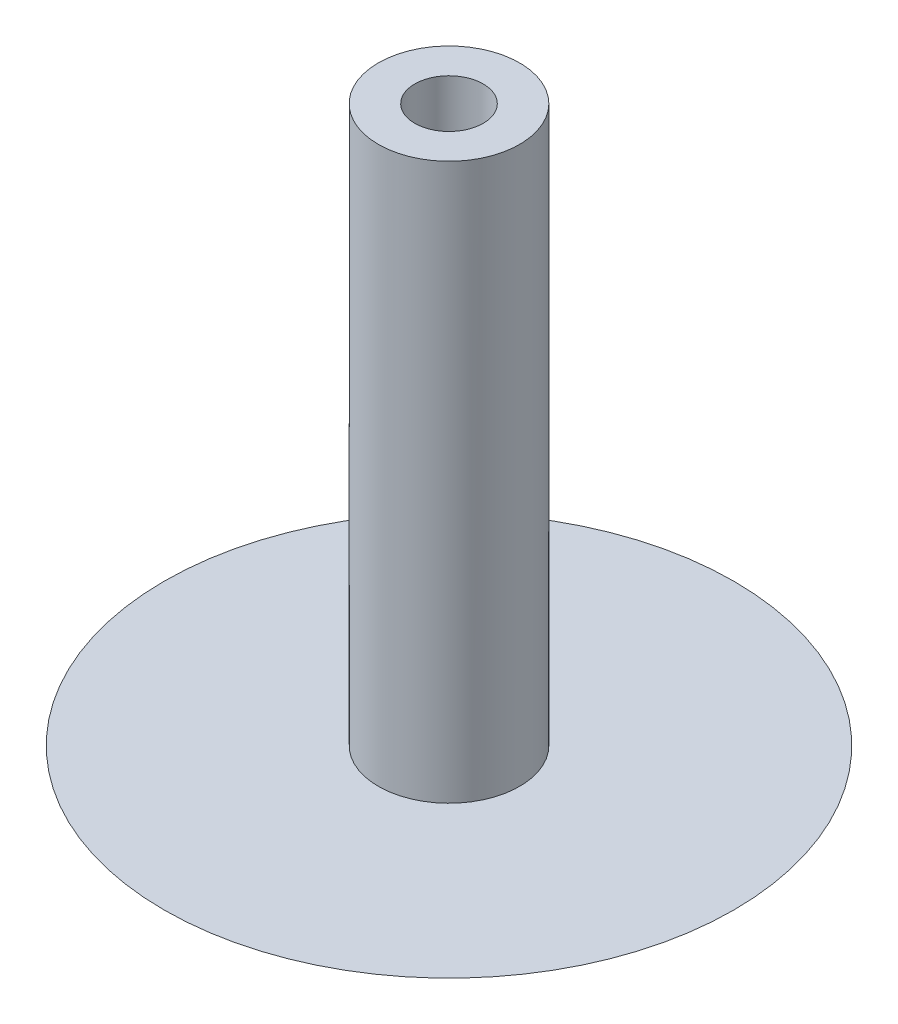
ISO-10303-21;
HEADER;
FILE_DESCRIPTION(('STEP AP214'),'2;1');
FILE_NAME('part.step','',(''),(''),'','','');
FILE_SCHEMA(('AUTOMOTIVE_DESIGN { 1 0 10303 214 1 1 1 1 }'));
ENDSEC;
DATA;
#1=APPLICATION_CONTEXT('core data for automotive mechanical design processes');
#2=APPLICATION_PROTOCOL_DEFINITION('international standard','automotive_design',2000,#1);
#3=PRODUCT_CONTEXT('',#1,'mechanical');
#4=PRODUCT('Part','Part','',(#3));
#5=PRODUCT_RELATED_PRODUCT_CATEGORY('part','',(#4));
#6=PRODUCT_DEFINITION_FORMATION('','',#4);
#7=PRODUCT_DEFINITION_CONTEXT('part definition',#1,'design');
#8=PRODUCT_DEFINITION('design','',#6,#7);
#9=PRODUCT_DEFINITION_SHAPE('','',#8);
#10=(LENGTH_UNIT() NAMED_UNIT(*) SI_UNIT(.MILLI.,.METRE.));
#11=(NAMED_UNIT(*) PLANE_ANGLE_UNIT() SI_UNIT($,.RADIAN.));
#12=(NAMED_UNIT(*) SI_UNIT($,.STERADIAN.) SOLID_ANGLE_UNIT());
#13=UNCERTAINTY_MEASURE_WITH_UNIT(LENGTH_MEASURE(1.E-05),#10,'distance_accuracy_value','');
#14=(GEOMETRIC_REPRESENTATION_CONTEXT(3) GLOBAL_UNCERTAINTY_ASSIGNED_CONTEXT((#13)) GLOBAL_UNIT_ASSIGNED_CONTEXT((#10,
#11,#12)) REPRESENTATION_CONTEXT('',''));
#15=CARTESIAN_POINT('',(0.,0.,0.));
#16=DIRECTION('',(0.,0.,1.));
#17=DIRECTION('',(1.,0.,0.));
#18=AXIS2_PLACEMENT_3D('',#15,#16,#17);
#19=CARTESIAN_POINT('',(0.,15.494,0.));
#20=DIRECTION('',(0.,1.,0.));
#21=DIRECTION('',(0.,0.,1.));
#22=AXIS2_PLACEMENT_3D('',#19,#20,#21);
#23=PLANE('',#22);
#24=CARTESIAN_POINT('',(0.,15.494,0.));
#25=DIRECTION('',(0.,1.,0.));
#26=DIRECTION('',(0.,0.,1.));
#27=AXIS2_PLACEMENT_3D('',#24,#25,#26);
#28=CIRCLE('',#27,1.9685);
#29=CARTESIAN_POINT('',(0.,15.494,1.9685));
#30=VERTEX_POINT('',#29);
#31=EDGE_CURVE('E10',#30,#30,#28,.T.);
#32=ORIENTED_EDGE('',*,*,#31,.T.);
#33=EDGE_LOOP('',(#32));
#34=FACE_BOUND('',#33,.T.);
#35=CARTESIAN_POINT('',(0.,15.494,0.));
#36=DIRECTION('',(0.,1.,0.));
#37=DIRECTION('',(0.,0.,1.));
#38=AXIS2_PLACEMENT_3D('',#35,#36,#37);
#39=CIRCLE('',#38,0.9525);
#40=CARTESIAN_POINT('',(0.,15.494,0.9525));
#41=VERTEX_POINT('',#40);
#42=EDGE_CURVE('E45',#41,#41,#39,.T.);
#43=ORIENTED_EDGE('',*,*,#42,.F.);
#44=EDGE_LOOP('',(#43));
#45=FACE_BOUND('',#44,.T.);
#46=ADVANCED_FACE('F37',(#34,#45),#23,.T.);
#47=CARTESIAN_POINT('',(0.,15.494,0.));
#48=DIRECTION('',(0.,-1.,0.));
#49=DIRECTION('',(0.,0.,-1.));
#50=AXIS2_PLACEMENT_3D('',#47,#48,#49);
#51=CYLINDRICAL_SURFACE('',#50,1.9685);
#52=ORIENTED_EDGE('',*,*,#31,.F.);
#53=EDGE_LOOP('',(#52));
#54=FACE_BOUND('',#53,.T.);
#55=CARTESIAN_POINT('',(0.,0.,0.));
#56=DIRECTION('',(0.,1.,0.));
#57=DIRECTION('',(-1.,0.,0.));
#58=AXIS2_PLACEMENT_3D('',#55,#56,#57);
#59=CIRCLE('',#58,1.9685);
#60=CARTESIAN_POINT('',(-1.9685,0.,0.));
#61=VERTEX_POINT('',#60);
#62=EDGE_CURVE('E56',#61,#61,#59,.T.);
#63=ORIENTED_EDGE('',*,*,#62,.T.);
#64=EDGE_LOOP('',(#63));
#65=FACE_BOUND('',#64,.T.);
#66=ADVANCED_FACE('F39',(#54,#65),#51,.T.);
#67=CARTESIAN_POINT('',(0.,15.494,0.));
#68=DIRECTION('',(0.,-1.,0.));
#69=DIRECTION('',(0.,0.,-1.));
#70=AXIS2_PLACEMENT_3D('',#67,#68,#69);
#71=CYLINDRICAL_SURFACE('',#70,0.9525);
#72=ORIENTED_EDGE('',*,*,#42,.T.);
#73=EDGE_LOOP('',(#72));
#74=FACE_BOUND('',#73,.T.);
#75=CARTESIAN_POINT('',(0.,0.,0.));
#76=DIRECTION('',(0.,1.,0.));
#77=DIRECTION('',(0.,0.,1.));
#78=AXIS2_PLACEMENT_3D('',#75,#76,#77);
#79=CIRCLE('',#78,0.9525);
#80=CARTESIAN_POINT('',(0.,0.,0.9525));
#81=VERTEX_POINT('',#80);
#82=EDGE_CURVE('E50',#81,#81,#79,.T.);
#83=ORIENTED_EDGE('',*,*,#82,.F.);
#84=EDGE_LOOP('',(#83));
#85=FACE_BOUND('',#84,.T.);
#86=ADVANCED_FACE('F78',(#74,#85),#71,.F.);
#87=CARTESIAN_POINT('',(0.,0.,0.));
#88=DIRECTION('',(0.,1.,0.));
#89=DIRECTION('',(-1.,0.,0.));
#90=AXIS2_PLACEMENT_3D('',#87,#88,#89);
#91=PLANE('',#90);
#92=ORIENTED_EDGE('',*,*,#82,.T.);
#93=EDGE_LOOP('',(#92));
#94=FACE_BOUND('',#93,.T.);
#95=ADVANCED_FACE('F70',(#94),#91,.T.);
#96=CARTESIAN_POINT('',(0.,11.13234375,0.));
#97=DIRECTION('',(0.,1.,0.));
#98=DIRECTION('',(1.,0.,0.));
#99=AXIS2_PLACEMENT_3D('',#96,#97,#98);
#100=SPHERICAL_SURFACE('',#99,13.67234375);
#101=CARTESIAN_POINT('',(0.,0.,0.));
#102=DIRECTION('',(0.,1.,0.));
#103=DIRECTION('',(-1.,0.,0.));
#104=AXIS2_PLACEMENT_3D('',#101,#102,#103);
#105=CIRCLE('',#104,7.9375);
#106=CARTESIAN_POINT('',(-7.9375,0.,0.));
#107=VERTEX_POINT('',#106);
#108=EDGE_CURVE('E61',#107,#107,#105,.T.);
#109=ORIENTED_EDGE('',*,*,#108,.F.);
#110=EDGE_LOOP('',(#109));
#111=FACE_BOUND('',#110,.T.);
#112=ADVANCED_FACE('F68',(#111),#100,.T.);
#113=ORIENTED_EDGE('',*,*,#62,.F.);
#114=EDGE_LOOP('',(#113));
#115=FACE_BOUND('',#114,.T.);
#116=ORIENTED_EDGE('',*,*,#108,.T.);
#117=EDGE_LOOP('',(#116));
#118=FACE_BOUND('',#117,.T.);
#119=ADVANCED_FACE('F66',(#115,#118),#91,.T.);
#120=CLOSED_SHELL('',(#46,#66,#86,#95,#112,#119));
#121=MANIFOLD_SOLID_BREP('B2',#120);
#122=ADVANCED_BREP_SHAPE_REPRESENTATION('',(#18,#121),#14);
#123=SHAPE_DEFINITION_REPRESENTATION(#9,#122);
ENDSEC;
END-ISO-10303-21;
